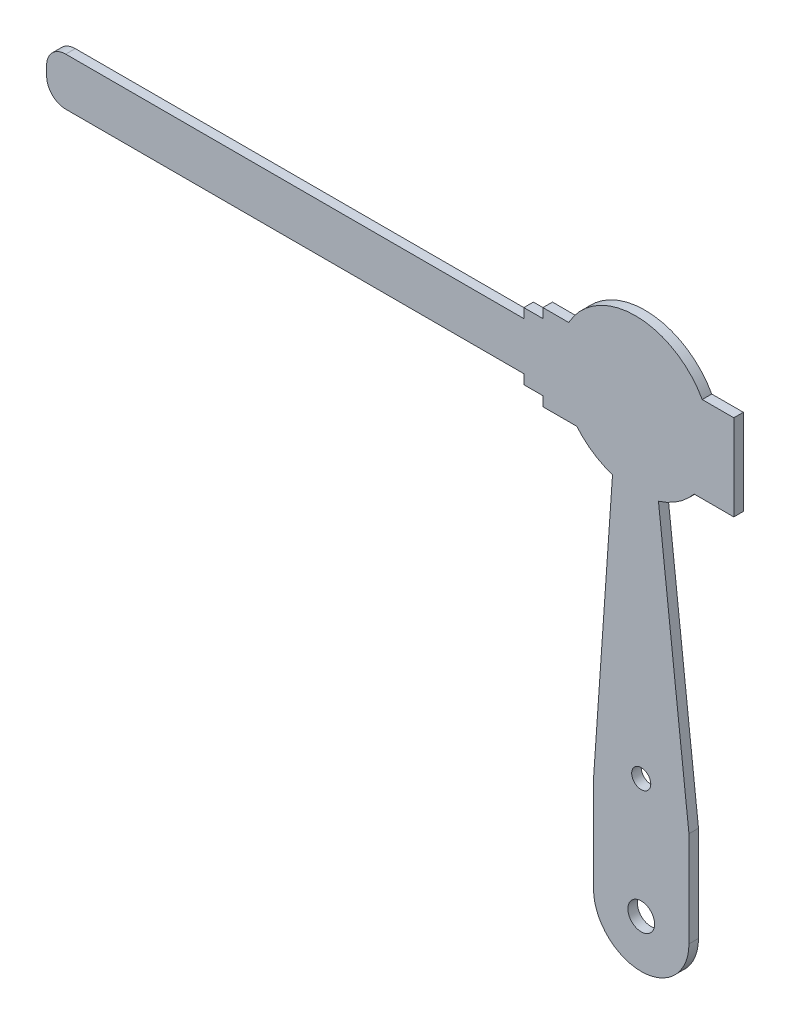
ISO-10303-21;
HEADER;
FILE_DESCRIPTION(('STEP AP214'),'2;1');
FILE_NAME('part.step','',(''),(''),'','','');
FILE_SCHEMA(('AUTOMOTIVE_DESIGN { 1 0 10303 214 1 1 1 1 }'));
ENDSEC;
DATA;
#1=APPLICATION_CONTEXT('core data for automotive mechanical design processes');
#2=APPLICATION_PROTOCOL_DEFINITION('international standard','automotive_design',2000,#1);
#3=PRODUCT_CONTEXT('',#1,'mechanical');
#4=PRODUCT('Part','Part','',(#3));
#5=PRODUCT_RELATED_PRODUCT_CATEGORY('part','',(#4));
#6=PRODUCT_DEFINITION_FORMATION('','',#4);
#7=PRODUCT_DEFINITION_CONTEXT('part definition',#1,'design');
#8=PRODUCT_DEFINITION('design','',#6,#7);
#9=PRODUCT_DEFINITION_SHAPE('','',#8);
#10=(LENGTH_UNIT() NAMED_UNIT(*) SI_UNIT(.MILLI.,.METRE.));
#11=(NAMED_UNIT(*) PLANE_ANGLE_UNIT() SI_UNIT($,.RADIAN.));
#12=(NAMED_UNIT(*) SI_UNIT($,.STERADIAN.) SOLID_ANGLE_UNIT());
#13=UNCERTAINTY_MEASURE_WITH_UNIT(LENGTH_MEASURE(1.E-05),#10,'distance_accuracy_value','');
#14=(GEOMETRIC_REPRESENTATION_CONTEXT(3) GLOBAL_UNCERTAINTY_ASSIGNED_CONTEXT((#13)) GLOBAL_UNIT_ASSIGNED_CONTEXT((#10,
#11,#12)) REPRESENTATION_CONTEXT('',''));
#15=CARTESIAN_POINT('',(0.,0.,0.));
#16=DIRECTION('',(0.,0.,1.));
#17=DIRECTION('',(1.,0.,0.));
#18=AXIS2_PLACEMENT_3D('',#15,#16,#17);
#19=CARTESIAN_POINT('',(-15.0936104431096,29.3338517533737,-1.));
#20=DIRECTION('',(0.,0.,1.));
#21=DIRECTION('',(1.,0.,0.));
#22=AXIS2_PLACEMENT_3D('',#19,#20,#21);
#23=CYLINDRICAL_SURFACE('',#22,2.00000000000009);
#24=CARTESIAN_POINT('',(-15.0936104431096,29.3338517533737,0.));
#25=DIRECTION('',(0.,0.,1.));
#26=DIRECTION('',(1.,0.,0.));
#27=AXIS2_PLACEMENT_3D('',#24,#25,#26);
#28=CIRCLE('',#27,2.00000000000009);
#29=CARTESIAN_POINT('',(-17.0936104431096,29.3338517533737,0.));
#30=VERTEX_POINT('',#29);
#31=CARTESIAN_POINT('',(-15.0936104431096,27.3338517533735,0.));
#32=VERTEX_POINT('',#31);
#33=EDGE_CURVE('E231',#30,#32,#28,.T.);
#34=ORIENTED_EDGE('',*,*,#33,.F.);
#35=DIRECTION('',(0.,0.,1.));
#36=VECTOR('',#35,1.);
#37=CARTESIAN_POINT('',(-17.0936104431096,29.3338517533737,-1.));
#38=LINE('',#37,#36);
#39=CARTESIAN_POINT('',(-17.0936104431096,29.3338517533737,-1.));
#40=VERTEX_POINT('',#39);
#41=EDGE_CURVE('E11',#40,#30,#38,.T.);
#42=ORIENTED_EDGE('',*,*,#41,.F.);
#43=CARTESIAN_POINT('',(-15.0936104431096,29.3338517533737,-1.));
#44=DIRECTION('',(0.,0.,1.));
#45=DIRECTION('',(1.,0.,0.));
#46=AXIS2_PLACEMENT_3D('',#43,#44,#45);
#47=CIRCLE('',#46,2.00000000000009);
#48=CARTESIAN_POINT('',(-15.0936104431096,27.3338517533735,-1.));
#49=VERTEX_POINT('',#48);
#50=EDGE_CURVE('E300',#40,#49,#47,.T.);
#51=ORIENTED_EDGE('',*,*,#50,.T.);
#52=DIRECTION('',(0.,0.,1.));
#53=VECTOR('',#52,1.);
#54=CARTESIAN_POINT('',(-15.0936104431096,27.3338517533735,-1.));
#55=LINE('',#54,#53);
#56=EDGE_CURVE('E41',#49,#32,#55,.T.);
#57=ORIENTED_EDGE('',*,*,#56,.T.);
#58=EDGE_LOOP('',(#34,#42,#51,#57));
#59=FACE_BOUND('',#58,.T.);
#60=ADVANCED_FACE('F38',(#59),#23,.T.);
#61=CARTESIAN_POINT('',(-17.0936104431096,29.3338517533737,-1.));
#62=DIRECTION('',(-1.,0.,0.));
#63=DIRECTION('',(0.,0.,1.));
#64=AXIS2_PLACEMENT_3D('',#61,#62,#63);
#65=PLANE('',#64);
#66=DIRECTION('',(0.,-1.,0.));
#67=VECTOR('',#66,1.);
#68=CARTESIAN_POINT('',(-17.0936104431096,29.3338517533737,0.));
#69=LINE('',#68,#67);
#70=CARTESIAN_POINT('',(-17.0936104431096,30.3338517533737,0.));
#71=VERTEX_POINT('',#70);
#72=EDGE_CURVE('E298',#71,#30,#69,.T.);
#73=ORIENTED_EDGE('',*,*,#72,.F.);
#74=DIRECTION('',(0.,0.,1.));
#75=VECTOR('',#74,1.);
#76=CARTESIAN_POINT('',(-17.0936104431096,30.3338517533737,-1.));
#77=LINE('',#76,#75);
#78=CARTESIAN_POINT('',(-17.0936104431096,30.3338517533737,-1.));
#79=VERTEX_POINT('',#78);
#80=EDGE_CURVE('E47',#79,#71,#77,.T.);
#81=ORIENTED_EDGE('',*,*,#80,.F.);
#82=DIRECTION('',(0.,-1.,0.));
#83=VECTOR('',#82,1.);
#84=CARTESIAN_POINT('',(-17.0936104431096,29.3338517533737,-1.));
#85=LINE('',#84,#83);
#86=EDGE_CURVE('E221',#79,#40,#85,.T.);
#87=ORIENTED_EDGE('',*,*,#86,.T.);
#88=ORIENTED_EDGE('',*,*,#41,.T.);
#89=EDGE_LOOP('',(#73,#81,#87,#88));
#90=FACE_BOUND('',#89,.T.);
#91=ADVANCED_FACE('F344',(#90),#65,.T.);
#92=CARTESIAN_POINT('',(-15.0936104431096,30.3338517533737,-1.));
#93=DIRECTION('',(0.,0.,1.));
#94=DIRECTION('',(1.,0.,0.));
#95=AXIS2_PLACEMENT_3D('',#92,#93,#94);
#96=CYLINDRICAL_SURFACE('',#95,2.00000000000001);
#97=CARTESIAN_POINT('',(-15.0936104431096,30.3338517533737,0.));
#98=DIRECTION('',(0.,0.,1.));
#99=DIRECTION('',(1.,0.,0.));
#100=AXIS2_PLACEMENT_3D('',#97,#98,#99);
#101=CIRCLE('',#100,2.00000000000001);
#102=CARTESIAN_POINT('',(-15.0936104431095,32.3338517533737,0.));
#103=VERTEX_POINT('',#102);
#104=EDGE_CURVE('E208',#103,#71,#101,.T.);
#105=ORIENTED_EDGE('',*,*,#104,.F.);
#106=DIRECTION('',(0.,0.,1.));
#107=VECTOR('',#106,1.);
#108=CARTESIAN_POINT('',(-15.0936104431095,32.3338517533737,-1.));
#109=LINE('',#108,#107);
#110=CARTESIAN_POINT('',(-15.0936104431095,32.3338517533737,-1.));
#111=VERTEX_POINT('',#110);
#112=EDGE_CURVE('E203',#111,#103,#109,.T.);
#113=ORIENTED_EDGE('',*,*,#112,.F.);
#114=CARTESIAN_POINT('',(-15.0936104431096,30.3338517533737,-1.));
#115=DIRECTION('',(0.,0.,1.));
#116=DIRECTION('',(1.,0.,0.));
#117=AXIS2_PLACEMENT_3D('',#114,#115,#116);
#118=CIRCLE('',#117,2.00000000000001);
#119=EDGE_CURVE('E206',#111,#79,#118,.T.);
#120=ORIENTED_EDGE('',*,*,#119,.T.);
#121=ORIENTED_EDGE('',*,*,#80,.T.);
#122=EDGE_LOOP('',(#105,#113,#120,#121));
#123=FACE_BOUND('',#122,.T.);
#124=ADVANCED_FACE('F205',(#123),#96,.T.);
#125=CARTESIAN_POINT('',(-15.0936104431095,32.3338517533737,-1.));
#126=DIRECTION('',(0.,1.,0.));
#127=DIRECTION('',(0.,0.,1.));
#128=AXIS2_PLACEMENT_3D('',#125,#126,#127);
#129=PLANE('',#128);
#130=DIRECTION('',(-1.,0.,0.));
#131=VECTOR('',#130,1.);
#132=CARTESIAN_POINT('',(-15.0936104431095,32.3338517533737,0.));
#133=LINE('',#132,#131);
#134=CARTESIAN_POINT('',(32.9063895568905,32.3338517533737,0.));
#135=VERTEX_POINT('',#134);
#136=EDGE_CURVE('E295',#135,#103,#133,.T.);
#137=ORIENTED_EDGE('',*,*,#136,.F.);
#138=DIRECTION('',(0.,0.,1.));
#139=VECTOR('',#138,1.);
#140=CARTESIAN_POINT('',(32.9063895568905,32.3338517533737,-1.));
#141=LINE('',#140,#139);
#142=CARTESIAN_POINT('',(32.9063895568905,32.3338517533737,-1.));
#143=VERTEX_POINT('',#142);
#144=EDGE_CURVE('E213',#143,#135,#141,.T.);
#145=ORIENTED_EDGE('',*,*,#144,.F.);
#146=DIRECTION('',(-1.,0.,0.));
#147=VECTOR('',#146,1.);
#148=CARTESIAN_POINT('',(-15.0936104431095,32.3338517533737,-1.));
#149=LINE('',#148,#147);
#150=EDGE_CURVE('E219',#143,#111,#149,.T.);
#151=ORIENTED_EDGE('',*,*,#150,.T.);
#152=ORIENTED_EDGE('',*,*,#112,.T.);
#153=EDGE_LOOP('',(#137,#145,#151,#152));
#154=FACE_BOUND('',#153,.T.);
#155=ADVANCED_FACE('F223',(#154),#129,.T.);
#156=CARTESIAN_POINT('',(32.9063895568905,32.3338517533737,-1.));
#157=DIRECTION('',(-1.,0.,0.));
#158=DIRECTION('',(0.,0.,1.));
#159=AXIS2_PLACEMENT_3D('',#156,#157,#158);
#160=PLANE('',#159);
#161=DIRECTION('',(0.,-1.,0.));
#162=VECTOR('',#161,1.);
#163=CARTESIAN_POINT('',(32.9063895568905,32.3338517533737,0.));
#164=LINE('',#163,#162);
#165=CARTESIAN_POINT('',(32.9063895568905,33.3338517533735,0.));
#166=VERTEX_POINT('',#165);
#167=EDGE_CURVE('E292',#166,#135,#164,.T.);
#168=ORIENTED_EDGE('',*,*,#167,.F.);
#169=DIRECTION('',(0.,0.,1.));
#170=VECTOR('',#169,1.);
#171=CARTESIAN_POINT('',(32.9063895568905,33.3338517533735,-1.));
#172=LINE('',#171,#170);
#173=CARTESIAN_POINT('',(32.9063895568905,33.3338517533735,-1.));
#174=VERTEX_POINT('',#173);
#175=EDGE_CURVE('E304',#174,#166,#172,.T.);
#176=ORIENTED_EDGE('',*,*,#175,.F.);
#177=DIRECTION('',(0.,-1.,0.));
#178=VECTOR('',#177,1.);
#179=CARTESIAN_POINT('',(32.9063895568905,32.3338517533737,-1.));
#180=LINE('',#179,#178);
#181=EDGE_CURVE('E224',#174,#143,#180,.T.);
#182=ORIENTED_EDGE('',*,*,#181,.T.);
#183=ORIENTED_EDGE('',*,*,#144,.T.);
#184=EDGE_LOOP('',(#168,#176,#182,#183));
#185=FACE_BOUND('',#184,.T.);
#186=ADVANCED_FACE('F357',(#185),#160,.T.);
#187=CARTESIAN_POINT('',(32.9063895568905,33.3338517533735,-1.));
#188=DIRECTION('',(0.,1.,0.));
#189=DIRECTION('',(0.,0.,1.));
#190=AXIS2_PLACEMENT_3D('',#187,#188,#189);
#191=PLANE('',#190);
#192=DIRECTION('',(-1.,0.,0.));
#193=VECTOR('',#192,1.);
#194=CARTESIAN_POINT('',(32.9063895568905,33.3338517533735,0.));
#195=LINE('',#194,#193);
#196=CARTESIAN_POINT('',(34.9063895568905,33.3338517533735,0.));
#197=VERTEX_POINT('',#196);
#198=EDGE_CURVE('E289',#197,#166,#195,.T.);
#199=ORIENTED_EDGE('',*,*,#198,.F.);
#200=DIRECTION('',(0.,0.,1.));
#201=VECTOR('',#200,1.);
#202=CARTESIAN_POINT('',(34.9063895568905,33.3338517533735,-1.));
#203=LINE('',#202,#201);
#204=CARTESIAN_POINT('',(34.9063895568905,33.3338517533735,-1.));
#205=VERTEX_POINT('',#204);
#206=EDGE_CURVE('E306',#205,#197,#203,.T.);
#207=ORIENTED_EDGE('',*,*,#206,.F.);
#208=DIRECTION('',(-1.,0.,0.));
#209=VECTOR('',#208,1.);
#210=CARTESIAN_POINT('',(32.9063895568905,33.3338517533735,-1.));
#211=LINE('',#210,#209);
#212=EDGE_CURVE('E226',#205,#174,#211,.T.);
#213=ORIENTED_EDGE('',*,*,#212,.T.);
#214=ORIENTED_EDGE('',*,*,#175,.T.);
#215=EDGE_LOOP('',(#199,#207,#213,#214));
#216=FACE_BOUND('',#215,.T.);
#217=ADVANCED_FACE('F360',(#216),#191,.T.);
#218=CARTESIAN_POINT('',(34.9063895568905,33.3338517533735,-1.));
#219=DIRECTION('',(-1.,0.,0.));
#220=DIRECTION('',(0.,0.,1.));
#221=AXIS2_PLACEMENT_3D('',#218,#219,#220);
#222=PLANE('',#221);
#223=DIRECTION('',(0.,-1.,0.));
#224=VECTOR('',#223,1.);
#225=CARTESIAN_POINT('',(34.9063895568905,33.3338517533735,0.));
#226=LINE('',#225,#224);
#227=CARTESIAN_POINT('',(34.9063895568905,34.3338517533735,0.));
#228=VERTEX_POINT('',#227);
#229=EDGE_CURVE('E286',#228,#197,#226,.T.);
#230=ORIENTED_EDGE('',*,*,#229,.F.);
#231=DIRECTION('',(0.,0.,1.));
#232=VECTOR('',#231,1.);
#233=CARTESIAN_POINT('',(34.9063895568905,34.3338517533735,-1.));
#234=LINE('',#233,#232);
#235=CARTESIAN_POINT('',(34.9063895568905,34.3338517533735,-1.));
#236=VERTEX_POINT('',#235);
#237=EDGE_CURVE('E308',#236,#228,#234,.T.);
#238=ORIENTED_EDGE('',*,*,#237,.F.);
#239=DIRECTION('',(0.,-1.,0.));
#240=VECTOR('',#239,1.);
#241=CARTESIAN_POINT('',(34.9063895568905,33.3338517533735,-1.));
#242=LINE('',#241,#240);
#243=EDGE_CURVE('E518',#236,#205,#242,.T.);
#244=ORIENTED_EDGE('',*,*,#243,.T.);
#245=ORIENTED_EDGE('',*,*,#206,.T.);
#246=EDGE_LOOP('',(#230,#238,#244,#245));
#247=FACE_BOUND('',#246,.T.);
#248=ADVANCED_FACE('F364',(#247),#222,.T.);
#249=CARTESIAN_POINT('',(34.9063895568905,34.3338517533735,-1.));
#250=DIRECTION('',(0.,1.,0.));
#251=DIRECTION('',(0.,0.,1.));
#252=AXIS2_PLACEMENT_3D('',#249,#250,#251);
#253=PLANE('',#252);
#254=DIRECTION('',(-1.,0.,0.));
#255=VECTOR('',#254,1.);
#256=CARTESIAN_POINT('',(34.9063895568905,34.3338517533735,0.));
#257=LINE('',#256,#255);
#258=CARTESIAN_POINT('',(37.6108311146424,34.3338517533735,0.));
#259=VERTEX_POINT('',#258);
#260=EDGE_CURVE('E283',#259,#228,#257,.T.);
#261=ORIENTED_EDGE('',*,*,#260,.F.);
#262=DIRECTION('',(0.,0.,1.));
#263=VECTOR('',#262,1.);
#264=CARTESIAN_POINT('',(37.6108311146424,34.3338517533735,-1.));
#265=LINE('',#264,#263);
#266=CARTESIAN_POINT('',(37.6108311146424,34.3338517533735,-1.));
#267=VERTEX_POINT('',#266);
#268=EDGE_CURVE('E310',#267,#259,#265,.T.);
#269=ORIENTED_EDGE('',*,*,#268,.F.);
#270=DIRECTION('',(-1.,0.,0.));
#271=VECTOR('',#270,1.);
#272=CARTESIAN_POINT('',(34.9063895568905,34.3338517533735,-1.));
#273=LINE('',#272,#271);
#274=EDGE_CURVE('E515',#267,#236,#273,.T.);
#275=ORIENTED_EDGE('',*,*,#274,.T.);
#276=ORIENTED_EDGE('',*,*,#237,.T.);
#277=EDGE_LOOP('',(#261,#269,#275,#276));
#278=FACE_BOUND('',#277,.T.);
#279=ADVANCED_FACE('F368',(#278),#253,.T.);
#280=CARTESIAN_POINT('',(44.6043633476465,30.4492015881806,-1.));
#281=DIRECTION('',(0.,0.,1.));
#282=DIRECTION('',(1.,0.,0.));
#283=AXIS2_PLACEMENT_3D('',#280,#281,#282);
#284=CYLINDRICAL_SURFACE('',#283,8.);
#285=CARTESIAN_POINT('',(44.6043633476465,30.4492015881806,0.));
#286=DIRECTION('',(0.,0.,1.));
#287=DIRECTION('',(-1.,0.,0.));
#288=AXIS2_PLACEMENT_3D('',#285,#286,#287);
#289=CIRCLE('',#288,8.);
#290=CARTESIAN_POINT('',(51.5978955806505,34.3338517533735,0.));
#291=VERTEX_POINT('',#290);
#292=EDGE_CURVE('E280',#291,#259,#289,.T.);
#293=ORIENTED_EDGE('',*,*,#292,.F.);
#294=DIRECTION('',(0.,0.,1.));
#295=VECTOR('',#294,1.);
#296=CARTESIAN_POINT('',(51.5978955806505,34.3338517533735,-1.));
#297=LINE('',#296,#295);
#298=CARTESIAN_POINT('',(51.5978955806505,34.3338517533735,-1.));
#299=VERTEX_POINT('',#298);
#300=EDGE_CURVE('E312',#299,#291,#297,.T.);
#301=ORIENTED_EDGE('',*,*,#300,.F.);
#302=CARTESIAN_POINT('',(44.6043633476465,30.4492015881806,-1.));
#303=DIRECTION('',(0.,0.,1.));
#304=DIRECTION('',(-1.,0.,0.));
#305=AXIS2_PLACEMENT_3D('',#302,#303,#304);
#306=CIRCLE('',#305,8.);
#307=EDGE_CURVE('E512',#299,#267,#306,.T.);
#308=ORIENTED_EDGE('',*,*,#307,.T.);
#309=ORIENTED_EDGE('',*,*,#268,.T.);
#310=EDGE_LOOP('',(#293,#301,#308,#309));
#311=FACE_BOUND('',#310,.T.);
#312=ADVANCED_FACE('F372',(#311),#284,.T.);
#313=CARTESIAN_POINT('',(51.5978955806505,34.3338517533735,-1.));
#314=DIRECTION('',(0.,1.,0.));
#315=DIRECTION('',(0.,0.,1.));
#316=AXIS2_PLACEMENT_3D('',#313,#314,#315);
#317=PLANE('',#316);
#318=DIRECTION('',(-1.,0.,0.));
#319=VECTOR('',#318,1.);
#320=CARTESIAN_POINT('',(51.5978955806505,34.3338517533735,0.));
#321=LINE('',#320,#319);
#322=CARTESIAN_POINT('',(54.9063895568905,34.3338517533735,0.));
#323=VERTEX_POINT('',#322);
#324=EDGE_CURVE('E277',#323,#291,#321,.T.);
#325=ORIENTED_EDGE('',*,*,#324,.F.);
#326=DIRECTION('',(0.,0.,1.));
#327=VECTOR('',#326,1.);
#328=CARTESIAN_POINT('',(54.9063895568905,34.3338517533735,-1.));
#329=LINE('',#328,#327);
#330=CARTESIAN_POINT('',(54.9063895568905,34.3338517533735,-1.));
#331=VERTEX_POINT('',#330);
#332=EDGE_CURVE('E314',#331,#323,#329,.T.);
#333=ORIENTED_EDGE('',*,*,#332,.F.);
#334=DIRECTION('',(-1.,0.,0.));
#335=VECTOR('',#334,1.);
#336=CARTESIAN_POINT('',(51.5978955806505,34.3338517533735,-1.));
#337=LINE('',#336,#335);
#338=EDGE_CURVE('E509',#331,#299,#337,.T.);
#339=ORIENTED_EDGE('',*,*,#338,.T.);
#340=ORIENTED_EDGE('',*,*,#300,.T.);
#341=EDGE_LOOP('',(#325,#333,#339,#340));
#342=FACE_BOUND('',#341,.T.);
#343=ADVANCED_FACE('F376',(#342),#317,.T.);
#344=CARTESIAN_POINT('',(54.9063895568905,34.3338517533735,-1.));
#345=DIRECTION('',(1.,0.,0.));
#346=DIRECTION('',(0.,1.,0.));
#347=AXIS2_PLACEMENT_3D('',#344,#345,#346);
#348=PLANE('',#347);
#349=DIRECTION('',(0.,1.,0.));
#350=VECTOR('',#349,1.);
#351=CARTESIAN_POINT('',(54.9063895568905,34.3338517533735,0.));
#352=LINE('',#351,#350);
#353=CARTESIAN_POINT('',(54.9063895568905,25.3338517533734,0.));
#354=VERTEX_POINT('',#353);
#355=EDGE_CURVE('E274',#354,#323,#352,.T.);
#356=ORIENTED_EDGE('',*,*,#355,.F.);
#357=DIRECTION('',(0.,0.,1.));
#358=VECTOR('',#357,1.);
#359=CARTESIAN_POINT('',(54.9063895568905,25.3338517533734,-1.));
#360=LINE('',#359,#358);
#361=CARTESIAN_POINT('',(54.9063895568905,25.3338517533734,-1.));
#362=VERTEX_POINT('',#361);
#363=EDGE_CURVE('E316',#362,#354,#360,.T.);
#364=ORIENTED_EDGE('',*,*,#363,.F.);
#365=DIRECTION('',(0.,1.,0.));
#366=VECTOR('',#365,1.);
#367=CARTESIAN_POINT('',(54.9063895568905,34.3338517533735,-1.));
#368=LINE('',#367,#366);
#369=EDGE_CURVE('E506',#362,#331,#368,.T.);
#370=ORIENTED_EDGE('',*,*,#369,.T.);
#371=ORIENTED_EDGE('',*,*,#332,.T.);
#372=EDGE_LOOP('',(#356,#364,#370,#371));
#373=FACE_BOUND('',#372,.T.);
#374=ADVANCED_FACE('F380',(#373),#348,.T.);
#375=CARTESIAN_POINT('',(54.9063895568905,25.3338517533734,-1.));
#376=DIRECTION('',(0.,-1.,0.));
#377=DIRECTION('',(1.,0.,0.));
#378=AXIS2_PLACEMENT_3D('',#375,#376,#377);
#379=PLANE('',#378);
#380=DIRECTION('',(1.,0.,0.));
#381=VECTOR('',#380,1.);
#382=CARTESIAN_POINT('',(54.9063895568905,25.3338517533734,0.));
#383=LINE('',#382,#381);
#384=CARTESIAN_POINT('',(50.7552328851621,25.3338517533734,0.));
#385=VERTEX_POINT('',#384);
#386=EDGE_CURVE('E271',#385,#354,#383,.T.);
#387=ORIENTED_EDGE('',*,*,#386,.F.);
#388=DIRECTION('',(0.,0.,1.));
#389=VECTOR('',#388,1.);
#390=CARTESIAN_POINT('',(50.7552328851621,25.3338517533734,-1.));
#391=LINE('',#390,#389);
#392=CARTESIAN_POINT('',(50.7552328851621,25.3338517533734,-1.));
#393=VERTEX_POINT('',#392);
#394=EDGE_CURVE('E318',#393,#385,#391,.T.);
#395=ORIENTED_EDGE('',*,*,#394,.F.);
#396=DIRECTION('',(1.,0.,0.));
#397=VECTOR('',#396,1.);
#398=CARTESIAN_POINT('',(54.9063895568905,25.3338517533734,-1.));
#399=LINE('',#398,#397);
#400=EDGE_CURVE('E503',#393,#362,#399,.T.);
#401=ORIENTED_EDGE('',*,*,#400,.T.);
#402=ORIENTED_EDGE('',*,*,#363,.T.);
#403=EDGE_LOOP('',(#387,#395,#401,#402));
#404=FACE_BOUND('',#403,.T.);
#405=ADVANCED_FACE('F384',(#404),#379,.T.);
#406=CARTESIAN_POINT('',(44.6043633476463,30.4492015881808,-1.));
#407=DIRECTION('',(0.,0.,1.));
#408=DIRECTION('',(1.,0.,0.));
#409=AXIS2_PLACEMENT_3D('',#406,#407,#408);
#410=CYLINDRICAL_SURFACE('',#409,8.0000000000002);
#411=CARTESIAN_POINT('',(44.6043633476463,30.4492015881808,0.));
#412=DIRECTION('',(0.,0.,1.));
#413=DIRECTION('',(1.,0.,0.));
#414=AXIS2_PLACEMENT_3D('',#411,#412,#413);
#415=CIRCLE('',#414,8.0000000000002);
#416=CARTESIAN_POINT('',(47.0108715570586,22.8197377644226,0.));
#417=VERTEX_POINT('',#416);
#418=EDGE_CURVE('E268',#417,#385,#415,.T.);
#419=ORIENTED_EDGE('',*,*,#418,.F.);
#420=DIRECTION('',(0.,0.,1.));
#421=VECTOR('',#420,1.);
#422=CARTESIAN_POINT('',(47.0108715570586,22.8197377644226,-1.));
#423=LINE('',#422,#421);
#424=CARTESIAN_POINT('',(47.0108715570586,22.8197377644226,-1.));
#425=VERTEX_POINT('',#424);
#426=EDGE_CURVE('E320',#425,#417,#423,.T.);
#427=ORIENTED_EDGE('',*,*,#426,.F.);
#428=CARTESIAN_POINT('',(44.6043633476463,30.4492015881808,-1.));
#429=DIRECTION('',(0.,0.,1.));
#430=DIRECTION('',(1.,0.,0.));
#431=AXIS2_PLACEMENT_3D('',#428,#429,#430);
#432=CIRCLE('',#431,8.0000000000002);
#433=EDGE_CURVE('E500',#425,#393,#432,.T.);
#434=ORIENTED_EDGE('',*,*,#433,.T.);
#435=ORIENTED_EDGE('',*,*,#394,.T.);
#436=EDGE_LOOP('',(#419,#427,#434,#435));
#437=FACE_BOUND('',#436,.T.);
#438=ADVANCED_FACE('F388',(#437),#410,.T.);
#439=CARTESIAN_POINT('',(50.2059903999995,-5.76156160002383,-1.));
#440=DIRECTION('',(0.993809401226692,0.111098487989008,0.));
#441=DIRECTION('',(-0.111098487989008,0.993809401226692,0.));
#442=AXIS2_PLACEMENT_3D('',#439,#440,#441);
#443=PLANE('',#442);
#444=DIRECTION('',(-0.111098487989008,0.993809401226692,0.));
#445=VECTOR('',#444,1.);
#446=CARTESIAN_POINT('',(50.2059903999995,-5.76156160002383,0.));
#447=LINE('',#446,#445);
#448=CARTESIAN_POINT('',(50.2059903999995,-5.76156160002383,0.));
#449=VERTEX_POINT('',#448);
#450=EDGE_CURVE('E265',#449,#417,#447,.T.);
#451=ORIENTED_EDGE('',*,*,#450,.F.);
#452=DIRECTION('',(0.,0.,1.));
#453=VECTOR('',#452,1.);
#454=CARTESIAN_POINT('',(50.2059903999995,-5.76156160002383,-1.));
#455=LINE('',#454,#453);
#456=CARTESIAN_POINT('',(50.2059903999995,-5.76156160002383,-1.));
#457=VERTEX_POINT('',#456);
#458=EDGE_CURVE('E322',#457,#449,#455,.T.);
#459=ORIENTED_EDGE('',*,*,#458,.F.);
#460=DIRECTION('',(-0.111098487989008,0.993809401226692,0.));
#461=VECTOR('',#460,1.);
#462=CARTESIAN_POINT('',(50.2059903999995,-5.76156160002383,-1.));
#463=LINE('',#462,#461);
#464=EDGE_CURVE('E497',#457,#425,#463,.T.);
#465=ORIENTED_EDGE('',*,*,#464,.T.);
#466=ORIENTED_EDGE('',*,*,#426,.T.);
#467=EDGE_LOOP('',(#451,#459,#465,#466));
#468=FACE_BOUND('',#467,.T.);
#469=ADVANCED_FACE('F392',(#468),#443,.T.);
#470=CARTESIAN_POINT('',(50.2059903999995,-5.76156160002383,-1.));
#471=DIRECTION('',(1.,0.,0.));
#472=DIRECTION('',(0.,1.,0.));
#473=AXIS2_PLACEMENT_3D('',#470,#471,#472);
#474=PLANE('',#473);
#475=DIRECTION('',(0.,1.,0.));
#476=VECTOR('',#475,1.);
#477=CARTESIAN_POINT('',(50.2059903999995,-5.76156160002383,0.));
#478=LINE('',#477,#476);
#479=CARTESIAN_POINT('',(50.2059903999995,-15.7615616000238,0.));
#480=VERTEX_POINT('',#479);
#481=EDGE_CURVE('E262',#480,#449,#478,.T.);
#482=ORIENTED_EDGE('',*,*,#481,.F.);
#483=DIRECTION('',(0.,0.,1.));
#484=VECTOR('',#483,1.);
#485=CARTESIAN_POINT('',(50.2059903999995,-15.7615616000238,-1.));
#486=LINE('',#485,#484);
#487=CARTESIAN_POINT('',(50.2059903999995,-15.7615616000238,-1.));
#488=VERTEX_POINT('',#487);
#489=EDGE_CURVE('E324',#488,#480,#486,.T.);
#490=ORIENTED_EDGE('',*,*,#489,.F.);
#491=DIRECTION('',(0.,1.,0.));
#492=VECTOR('',#491,1.);
#493=CARTESIAN_POINT('',(50.2059903999995,-5.76156160002383,-1.));
#494=LINE('',#493,#492);
#495=EDGE_CURVE('E494',#488,#457,#494,.T.);
#496=ORIENTED_EDGE('',*,*,#495,.T.);
#497=ORIENTED_EDGE('',*,*,#458,.T.);
#498=EDGE_LOOP('',(#482,#490,#496,#497));
#499=FACE_BOUND('',#498,.T.);
#500=ADVANCED_FACE('F396',(#499),#474,.T.);
#501=CARTESIAN_POINT('',(45.2059903999995,-15.7615616000238,-1.));
#502=DIRECTION('',(0.,0.,1.));
#503=DIRECTION('',(1.,0.,0.));
#504=AXIS2_PLACEMENT_3D('',#501,#502,#503);
#505=CYLINDRICAL_SURFACE('',#504,5.);
#506=CARTESIAN_POINT('',(45.2059903999995,-15.7615616000238,0.));
#507=DIRECTION('',(0.,0.,1.));
#508=DIRECTION('',(1.,0.,0.));
#509=AXIS2_PLACEMENT_3D('',#506,#507,#508);
#510=CIRCLE('',#509,5.);
#511=CARTESIAN_POINT('',(40.2059903999995,-15.7615616000238,0.));
#512=VERTEX_POINT('',#511);
#513=EDGE_CURVE('E259',#512,#480,#510,.T.);
#514=ORIENTED_EDGE('',*,*,#513,.F.);
#515=DIRECTION('',(0.,0.,1.));
#516=VECTOR('',#515,1.);
#517=CARTESIAN_POINT('',(40.2059903999995,-15.7615616000238,-1.));
#518=LINE('',#517,#516);
#519=CARTESIAN_POINT('',(40.2059903999995,-15.7615616000238,-1.));
#520=VERTEX_POINT('',#519);
#521=EDGE_CURVE('E326',#520,#512,#518,.T.);
#522=ORIENTED_EDGE('',*,*,#521,.F.);
#523=CARTESIAN_POINT('',(45.2059903999995,-15.7615616000238,-1.));
#524=DIRECTION('',(0.,0.,1.));
#525=DIRECTION('',(1.,0.,0.));
#526=AXIS2_PLACEMENT_3D('',#523,#524,#525);
#527=CIRCLE('',#526,5.);
#528=EDGE_CURVE('E491',#520,#488,#527,.T.);
#529=ORIENTED_EDGE('',*,*,#528,.T.);
#530=ORIENTED_EDGE('',*,*,#489,.T.);
#531=EDGE_LOOP('',(#514,#522,#529,#530));
#532=FACE_BOUND('',#531,.T.);
#533=ADVANCED_FACE('F400',(#532),#505,.T.);
#534=CARTESIAN_POINT('',(40.2059903999995,-5.76156160002383,-1.));
#535=DIRECTION('',(-1.,0.,0.));
#536=DIRECTION('',(0.,-1.,0.));
#537=AXIS2_PLACEMENT_3D('',#534,#535,#536);
#538=PLANE('',#537);
#539=DIRECTION('',(0.,-1.,0.));
#540=VECTOR('',#539,1.);
#541=CARTESIAN_POINT('',(40.2059903999995,-5.76156160002383,0.));
#542=LINE('',#541,#540);
#543=CARTESIAN_POINT('',(40.2059903999995,-5.76156160002383,0.));
#544=VERTEX_POINT('',#543);
#545=EDGE_CURVE('E256',#544,#512,#542,.T.);
#546=ORIENTED_EDGE('',*,*,#545,.F.);
#547=DIRECTION('',(0.,0.,1.));
#548=VECTOR('',#547,1.);
#549=CARTESIAN_POINT('',(40.2059903999995,-5.76156160002383,-1.));
#550=LINE('',#549,#548);
#551=CARTESIAN_POINT('',(40.2059903999995,-5.76156160002383,-1.));
#552=VERTEX_POINT('',#551);
#553=EDGE_CURVE('E328',#552,#544,#550,.T.);
#554=ORIENTED_EDGE('',*,*,#553,.F.);
#555=DIRECTION('',(0.,-1.,0.));
#556=VECTOR('',#555,1.);
#557=CARTESIAN_POINT('',(40.2059903999995,-5.76156160002383,-1.));
#558=LINE('',#557,#556);
#559=EDGE_CURVE('E488',#552,#520,#558,.T.);
#560=ORIENTED_EDGE('',*,*,#559,.T.);
#561=ORIENTED_EDGE('',*,*,#521,.T.);
#562=EDGE_LOOP('',(#546,#554,#560,#561));
#563=FACE_BOUND('',#562,.T.);
#564=ADVANCED_FACE('F404',(#563),#538,.T.);
#565=CARTESIAN_POINT('',(40.2059903999995,-5.76156160002383,-1.));
#566=DIRECTION('',(-0.997580379345878,0.069522562842112,0.));
#567=DIRECTION('',(-0.069522562842112,-0.997580379345878,0.));
#568=AXIS2_PLACEMENT_3D('',#565,#566,#567);
#569=PLANE('',#568);
#570=DIRECTION('',(-0.069522562842112,-0.997580379345877,0.));
#571=VECTOR('',#570,1.);
#572=CARTESIAN_POINT('',(40.2059903999995,-5.76156160002383,0.));
#573=LINE('',#572,#571);
#574=CARTESIAN_POINT('',(42.1978551382343,22.8197377644226,0.));
#575=VERTEX_POINT('',#574);
#576=EDGE_CURVE('E253',#575,#544,#573,.T.);
#577=ORIENTED_EDGE('',*,*,#576,.F.);
#578=DIRECTION('',(0.,0.,1.));
#579=VECTOR('',#578,1.);
#580=CARTESIAN_POINT('',(42.1978551382343,22.8197377644226,-1.));
#581=LINE('',#580,#579);
#582=CARTESIAN_POINT('',(42.1978551382343,22.8197377644226,-1.));
#583=VERTEX_POINT('',#582);
#584=EDGE_CURVE('E330',#583,#575,#581,.T.);
#585=ORIENTED_EDGE('',*,*,#584,.F.);
#586=DIRECTION('',(-0.069522562842112,-0.997580379345877,0.));
#587=VECTOR('',#586,1.);
#588=CARTESIAN_POINT('',(40.2059903999995,-5.76156160002383,-1.));
#589=LINE('',#588,#587);
#590=EDGE_CURVE('E485',#583,#552,#589,.T.);
#591=ORIENTED_EDGE('',*,*,#590,.T.);
#592=ORIENTED_EDGE('',*,*,#553,.T.);
#593=EDGE_LOOP('',(#577,#585,#591,#592));
#594=FACE_BOUND('',#593,.T.);
#595=ADVANCED_FACE('F408',(#594),#569,.T.);
#596=CARTESIAN_POINT('',(44.6043633476466,30.4492015881809,-1.));
#597=DIRECTION('',(0.,0.,1.));
#598=DIRECTION('',(1.,0.,0.));
#599=AXIS2_PLACEMENT_3D('',#596,#597,#598);
#600=CYLINDRICAL_SURFACE('',#599,8.00000000000028);
#601=CARTESIAN_POINT('',(44.6043633476466,30.4492015881809,0.));
#602=DIRECTION('',(0.,0.,1.));
#603=DIRECTION('',(-1.,0.,0.));
#604=AXIS2_PLACEMENT_3D('',#601,#602,#603);
#605=CIRCLE('',#604,8.00000000000028);
#606=CARTESIAN_POINT('',(38.4534938101308,25.3338517533734,0.));
#607=VERTEX_POINT('',#606);
#608=EDGE_CURVE('E250',#607,#575,#605,.T.);
#609=ORIENTED_EDGE('',*,*,#608,.F.);
#610=DIRECTION('',(0.,0.,1.));
#611=VECTOR('',#610,1.);
#612=CARTESIAN_POINT('',(38.4534938101308,25.3338517533734,-1.));
#613=LINE('',#612,#611);
#614=CARTESIAN_POINT('',(38.4534938101308,25.3338517533734,-1.));
#615=VERTEX_POINT('',#614);
#616=EDGE_CURVE('E332',#615,#607,#613,.T.);
#617=ORIENTED_EDGE('',*,*,#616,.F.);
#618=CARTESIAN_POINT('',(44.6043633476466,30.4492015881809,-1.));
#619=DIRECTION('',(0.,0.,1.));
#620=DIRECTION('',(-1.,0.,0.));
#621=AXIS2_PLACEMENT_3D('',#618,#619,#620);
#622=CIRCLE('',#621,8.00000000000028);
#623=EDGE_CURVE('E482',#615,#583,#622,.T.);
#624=ORIENTED_EDGE('',*,*,#623,.T.);
#625=ORIENTED_EDGE('',*,*,#584,.T.);
#626=EDGE_LOOP('',(#609,#617,#624,#625));
#627=FACE_BOUND('',#626,.T.);
#628=ADVANCED_FACE('F412',(#627),#600,.T.);
#629=CARTESIAN_POINT('',(34.9063895568904,25.3338517533734,-1.));
#630=DIRECTION('',(0.,-1.,0.));
#631=DIRECTION('',(0.,0.,-1.));
#632=AXIS2_PLACEMENT_3D('',#629,#630,#631);
#633=PLANE('',#632);
#634=DIRECTION('',(1.,0.,0.));
#635=VECTOR('',#634,1.);
#636=CARTESIAN_POINT('',(34.9063895568904,25.3338517533734,0.));
#637=LINE('',#636,#635);
#638=CARTESIAN_POINT('',(34.9063895568904,25.3338517533734,0.));
#639=VERTEX_POINT('',#638);
#640=EDGE_CURVE('E247',#639,#607,#637,.T.);
#641=ORIENTED_EDGE('',*,*,#640,.F.);
#642=DIRECTION('',(0.,0.,1.));
#643=VECTOR('',#642,1.);
#644=CARTESIAN_POINT('',(34.9063895568904,25.3338517533734,-1.));
#645=LINE('',#644,#643);
#646=CARTESIAN_POINT('',(34.9063895568904,25.3338517533734,-1.));
#647=VERTEX_POINT('',#646);
#648=EDGE_CURVE('E334',#647,#639,#645,.T.);
#649=ORIENTED_EDGE('',*,*,#648,.F.);
#650=DIRECTION('',(1.,0.,0.));
#651=VECTOR('',#650,1.);
#652=CARTESIAN_POINT('',(34.9063895568904,25.3338517533734,-1.));
#653=LINE('',#652,#651);
#654=EDGE_CURVE('E479',#647,#615,#653,.T.);
#655=ORIENTED_EDGE('',*,*,#654,.T.);
#656=ORIENTED_EDGE('',*,*,#616,.T.);
#657=EDGE_LOOP('',(#641,#649,#655,#656));
#658=FACE_BOUND('',#657,.T.);
#659=ADVANCED_FACE('F416',(#658),#633,.T.);
#660=CARTESIAN_POINT('',(34.9063895568904,25.3338517533734,-1.));
#661=DIRECTION('',(-1.,0.,0.));
#662=DIRECTION('',(0.,0.,1.));
#663=AXIS2_PLACEMENT_3D('',#660,#661,#662);
#664=PLANE('',#663);
#665=DIRECTION('',(0.,-1.,0.));
#666=VECTOR('',#665,1.);
#667=CARTESIAN_POINT('',(34.9063895568904,25.3338517533734,0.));
#668=LINE('',#667,#666);
#669=CARTESIAN_POINT('',(34.9063895568904,26.3338517533735,0.));
#670=VERTEX_POINT('',#669);
#671=EDGE_CURVE('E244',#670,#639,#668,.T.);
#672=ORIENTED_EDGE('',*,*,#671,.F.);
#673=DIRECTION('',(0.,0.,1.));
#674=VECTOR('',#673,1.);
#675=CARTESIAN_POINT('',(34.9063895568904,26.3338517533735,-1.));
#676=LINE('',#675,#674);
#677=CARTESIAN_POINT('',(34.9063895568904,26.3338517533735,-1.));
#678=VERTEX_POINT('',#677);
#679=EDGE_CURVE('E336',#678,#670,#676,.T.);
#680=ORIENTED_EDGE('',*,*,#679,.F.);
#681=DIRECTION('',(0.,-1.,0.));
#682=VECTOR('',#681,1.);
#683=CARTESIAN_POINT('',(34.9063895568904,25.3338517533734,-1.));
#684=LINE('',#683,#682);
#685=EDGE_CURVE('E476',#678,#647,#684,.T.);
#686=ORIENTED_EDGE('',*,*,#685,.T.);
#687=ORIENTED_EDGE('',*,*,#648,.T.);
#688=EDGE_LOOP('',(#672,#680,#686,#687));
#689=FACE_BOUND('',#688,.T.);
#690=ADVANCED_FACE('F420',(#689),#664,.T.);
#691=CARTESIAN_POINT('',(34.9063895568904,26.3338517533735,-1.));
#692=DIRECTION('',(0.,-1.,0.));
#693=DIRECTION('',(0.,0.,-1.));
#694=AXIS2_PLACEMENT_3D('',#691,#692,#693);
#695=PLANE('',#694);
#696=DIRECTION('',(1.,0.,0.));
#697=VECTOR('',#696,1.);
#698=CARTESIAN_POINT('',(34.9063895568904,26.3338517533735,0.));
#699=LINE('',#698,#697);
#700=CARTESIAN_POINT('',(32.9063895568904,26.3338517533735,0.));
#701=VERTEX_POINT('',#700);
#702=EDGE_CURVE('E241',#701,#670,#699,.T.);
#703=ORIENTED_EDGE('',*,*,#702,.F.);
#704=DIRECTION('',(0.,0.,1.));
#705=VECTOR('',#704,1.);
#706=CARTESIAN_POINT('',(32.9063895568904,26.3338517533735,-1.));
#707=LINE('',#706,#705);
#708=CARTESIAN_POINT('',(32.9063895568904,26.3338517533735,-1.));
#709=VERTEX_POINT('',#708);
#710=EDGE_CURVE('E338',#709,#701,#707,.T.);
#711=ORIENTED_EDGE('',*,*,#710,.F.);
#712=DIRECTION('',(1.,0.,0.));
#713=VECTOR('',#712,1.);
#714=CARTESIAN_POINT('',(34.9063895568904,26.3338517533735,-1.));
#715=LINE('',#714,#713);
#716=EDGE_CURVE('E473',#709,#678,#715,.T.);
#717=ORIENTED_EDGE('',*,*,#716,.T.);
#718=ORIENTED_EDGE('',*,*,#679,.T.);
#719=EDGE_LOOP('',(#703,#711,#717,#718));
#720=FACE_BOUND('',#719,.T.);
#721=ADVANCED_FACE('F424',(#720),#695,.T.);
#722=CARTESIAN_POINT('',(32.9063895568904,26.3338517533735,-1.));
#723=DIRECTION('',(-1.,0.,0.));
#724=DIRECTION('',(0.,0.,1.));
#725=AXIS2_PLACEMENT_3D('',#722,#723,#724);
#726=PLANE('',#725);
#727=DIRECTION('',(0.,-1.,0.));
#728=VECTOR('',#727,1.);
#729=CARTESIAN_POINT('',(32.9063895568904,26.3338517533735,0.));
#730=LINE('',#729,#728);
#731=CARTESIAN_POINT('',(32.9063895568904,27.3338517533735,0.));
#732=VERTEX_POINT('',#731);
#733=EDGE_CURVE('E238',#732,#701,#730,.T.);
#734=ORIENTED_EDGE('',*,*,#733,.F.);
#735=DIRECTION('',(0.,0.,1.));
#736=VECTOR('',#735,1.);
#737=CARTESIAN_POINT('',(32.9063895568904,27.3338517533735,-1.));
#738=LINE('',#737,#736);
#739=CARTESIAN_POINT('',(32.9063895568904,27.3338517533735,-1.));
#740=VERTEX_POINT('',#739);
#741=EDGE_CURVE('E339',#740,#732,#738,.T.);
#742=ORIENTED_EDGE('',*,*,#741,.F.);
#743=DIRECTION('',(0.,-1.,0.));
#744=VECTOR('',#743,1.);
#745=CARTESIAN_POINT('',(32.9063895568904,26.3338517533735,-1.));
#746=LINE('',#745,#744);
#747=EDGE_CURVE('E470',#740,#709,#746,.T.);
#748=ORIENTED_EDGE('',*,*,#747,.T.);
#749=ORIENTED_EDGE('',*,*,#710,.T.);
#750=EDGE_LOOP('',(#734,#742,#748,#749));
#751=FACE_BOUND('',#750,.T.);
#752=ADVANCED_FACE('F428',(#751),#726,.T.);
#753=CARTESIAN_POINT('',(32.9063895568904,27.3338517533735,-1.));
#754=DIRECTION('',(0.,-1.,0.));
#755=DIRECTION('',(0.,0.,-1.));
#756=AXIS2_PLACEMENT_3D('',#753,#754,#755);
#757=PLANE('',#756);
#758=DIRECTION('',(1.,0.,0.));
#759=VECTOR('',#758,1.);
#760=CARTESIAN_POINT('',(32.9063895568904,27.3338517533735,0.));
#761=LINE('',#760,#759);
#762=EDGE_CURVE('E234',#32,#732,#761,.T.);
#763=ORIENTED_EDGE('',*,*,#762,.F.);
#764=ORIENTED_EDGE('',*,*,#56,.F.);
#765=DIRECTION('',(1.,0.,0.));
#766=VECTOR('',#765,1.);
#767=CARTESIAN_POINT('',(32.9063895568904,27.3338517533735,-1.));
#768=LINE('',#767,#766);
#769=EDGE_CURVE('E468',#49,#740,#768,.T.);
#770=ORIENTED_EDGE('',*,*,#769,.T.);
#771=ORIENTED_EDGE('',*,*,#741,.T.);
#772=EDGE_LOOP('',(#763,#764,#770,#771));
#773=FACE_BOUND('',#772,.T.);
#774=ADVANCED_FACE('F341',(#773),#757,.T.);
#775=CARTESIAN_POINT('',(-15.0936104431096,29.3338517533737,-1.));
#776=DIRECTION('',(0.,0.,1.));
#777=DIRECTION('',(1.,0.,0.));
#778=AXIS2_PLACEMENT_3D('',#775,#776,#777);
#779=PLANE('',#778);
#780=CARTESIAN_POINT('',(45.2059903999995,-3.26156160002383,-1.));
#781=DIRECTION('',(0.,0.,1.));
#782=DIRECTION('',(1.,0.,0.));
#783=AXIS2_PLACEMENT_3D('',#780,#781,#782);
#784=CIRCLE('',#783,0.9999999999584);
#785=CARTESIAN_POINT('',(46.2059903999579,-3.26156160002383,-1.));
#786=VERTEX_POINT('',#785);
#787=EDGE_CURVE('E455',#786,#786,#784,.T.);
#788=ORIENTED_EDGE('',*,*,#787,.T.);
#789=EDGE_LOOP('',(#788));
#790=FACE_BOUND('',#789,.T.);
#791=CARTESIAN_POINT('',(45.2059903999995,-15.7615616000238,-1.));
#792=DIRECTION('',(0.,0.,1.));
#793=DIRECTION('',(1.,0.,0.));
#794=AXIS2_PLACEMENT_3D('',#791,#792,#793);
#795=CIRCLE('',#794,1.3999999999584);
#796=CARTESIAN_POINT('',(46.6059903999579,-15.7615616000238,-1.));
#797=VERTEX_POINT('',#796);
#798=EDGE_CURVE('E235',#797,#797,#795,.T.);
#799=ORIENTED_EDGE('',*,*,#798,.T.);
#800=EDGE_LOOP('',(#799));
#801=FACE_BOUND('',#800,.T.);
#802=ORIENTED_EDGE('',*,*,#50,.F.);
#803=ORIENTED_EDGE('',*,*,#86,.F.);
#804=ORIENTED_EDGE('',*,*,#119,.F.);
#805=ORIENTED_EDGE('',*,*,#150,.F.);
#806=ORIENTED_EDGE('',*,*,#181,.F.);
#807=ORIENTED_EDGE('',*,*,#212,.F.);
#808=ORIENTED_EDGE('',*,*,#243,.F.);
#809=ORIENTED_EDGE('',*,*,#274,.F.);
#810=ORIENTED_EDGE('',*,*,#307,.F.);
#811=ORIENTED_EDGE('',*,*,#338,.F.);
#812=ORIENTED_EDGE('',*,*,#369,.F.);
#813=ORIENTED_EDGE('',*,*,#400,.F.);
#814=ORIENTED_EDGE('',*,*,#433,.F.);
#815=ORIENTED_EDGE('',*,*,#464,.F.);
#816=ORIENTED_EDGE('',*,*,#495,.F.);
#817=ORIENTED_EDGE('',*,*,#528,.F.);
#818=ORIENTED_EDGE('',*,*,#559,.F.);
#819=ORIENTED_EDGE('',*,*,#590,.F.);
#820=ORIENTED_EDGE('',*,*,#623,.F.);
#821=ORIENTED_EDGE('',*,*,#654,.F.);
#822=ORIENTED_EDGE('',*,*,#685,.F.);
#823=ORIENTED_EDGE('',*,*,#716,.F.);
#824=ORIENTED_EDGE('',*,*,#747,.F.);
#825=ORIENTED_EDGE('',*,*,#769,.F.);
#826=EDGE_LOOP('',(#802,#803,#804,#805,#806,#807,#808,#809,#810,#811,#812,#813,#814,#815,#816,
#817,#818,#819,#820,#821,#822,#823,#824,#825));
#827=FACE_BOUND('',#826,.T.);
#828=ADVANCED_FACE('F217',(#790,#801,#827),#779,.F.);
#829=CARTESIAN_POINT('',(-15.0936104431096,29.3338517533737,0.));
#830=DIRECTION('',(0.,0.,1.));
#831=DIRECTION('',(1.,0.,0.));
#832=AXIS2_PLACEMENT_3D('',#829,#830,#831);
#833=PLANE('',#832);
#834=CARTESIAN_POINT('',(45.2059903999995,-3.26156160002383,0.));
#835=DIRECTION('',(0.,0.,1.));
#836=DIRECTION('',(1.,0.,0.));
#837=AXIS2_PLACEMENT_3D('',#834,#835,#836);
#838=CIRCLE('',#837,0.9999999999584);
#839=CARTESIAN_POINT('',(46.2059903999579,-3.26156160002383,0.));
#840=VERTEX_POINT('',#839);
#841=EDGE_CURVE('E458',#840,#840,#838,.T.);
#842=ORIENTED_EDGE('',*,*,#841,.F.);
#843=EDGE_LOOP('',(#842));
#844=FACE_BOUND('',#843,.T.);
#845=CARTESIAN_POINT('',(45.2059903999995,-15.7615616000238,0.));
#846=DIRECTION('',(0.,0.,1.));
#847=DIRECTION('',(1.,0.,0.));
#848=AXIS2_PLACEMENT_3D('',#845,#846,#847);
#849=CIRCLE('',#848,1.3999999999584);
#850=CARTESIAN_POINT('',(46.6059903999579,-15.7615616000238,0.));
#851=VERTEX_POINT('',#850);
#852=EDGE_CURVE('E460',#851,#851,#849,.T.);
#853=ORIENTED_EDGE('',*,*,#852,.F.);
#854=EDGE_LOOP('',(#853));
#855=FACE_BOUND('',#854,.T.);
#856=ORIENTED_EDGE('',*,*,#33,.T.);
#857=ORIENTED_EDGE('',*,*,#762,.T.);
#858=ORIENTED_EDGE('',*,*,#733,.T.);
#859=ORIENTED_EDGE('',*,*,#702,.T.);
#860=ORIENTED_EDGE('',*,*,#671,.T.);
#861=ORIENTED_EDGE('',*,*,#640,.T.);
#862=ORIENTED_EDGE('',*,*,#608,.T.);
#863=ORIENTED_EDGE('',*,*,#576,.T.);
#864=ORIENTED_EDGE('',*,*,#545,.T.);
#865=ORIENTED_EDGE('',*,*,#513,.T.);
#866=ORIENTED_EDGE('',*,*,#481,.T.);
#867=ORIENTED_EDGE('',*,*,#450,.T.);
#868=ORIENTED_EDGE('',*,*,#418,.T.);
#869=ORIENTED_EDGE('',*,*,#386,.T.);
#870=ORIENTED_EDGE('',*,*,#355,.T.);
#871=ORIENTED_EDGE('',*,*,#324,.T.);
#872=ORIENTED_EDGE('',*,*,#292,.T.);
#873=ORIENTED_EDGE('',*,*,#260,.T.);
#874=ORIENTED_EDGE('',*,*,#229,.T.);
#875=ORIENTED_EDGE('',*,*,#198,.T.);
#876=ORIENTED_EDGE('',*,*,#167,.T.);
#877=ORIENTED_EDGE('',*,*,#136,.T.);
#878=ORIENTED_EDGE('',*,*,#104,.T.);
#879=ORIENTED_EDGE('',*,*,#72,.T.);
#880=EDGE_LOOP('',(#856,#857,#858,#859,#860,#861,#862,#863,#864,#865,#866,#867,#868,#869,#870,
#871,#872,#873,#874,#875,#876,#877,#878,#879));
#881=FACE_BOUND('',#880,.T.);
#882=ADVANCED_FACE('F343',(#844,#855,#881),#833,.T.);
#883=CARTESIAN_POINT('',(45.2059903999995,-15.7615616000238,-1.));
#884=DIRECTION('',(0.,0.,1.));
#885=DIRECTION('',(1.,0.,0.));
#886=AXIS2_PLACEMENT_3D('',#883,#884,#885);
#887=CYLINDRICAL_SURFACE('',#886,1.3999999999584);
#888=ORIENTED_EDGE('',*,*,#798,.F.);
#889=EDGE_LOOP('',(#888));
#890=FACE_BOUND('',#889,.T.);
#891=ORIENTED_EDGE('',*,*,#852,.T.);
#892=EDGE_LOOP('',(#891));
#893=FACE_BOUND('',#892,.T.);
#894=ADVANCED_FACE('F440',(#890,#893),#887,.F.);
#895=CARTESIAN_POINT('',(45.2059903999995,-3.26156160002383,-1.));
#896=DIRECTION('',(0.,0.,1.));
#897=DIRECTION('',(1.,0.,0.));
#898=AXIS2_PLACEMENT_3D('',#895,#896,#897);
#899=CYLINDRICAL_SURFACE('',#898,0.9999999999584);
#900=ORIENTED_EDGE('',*,*,#787,.F.);
#901=EDGE_LOOP('',(#900));
#902=FACE_BOUND('',#901,.T.);
#903=ORIENTED_EDGE('',*,*,#841,.T.);
#904=EDGE_LOOP('',(#903));
#905=FACE_BOUND('',#904,.T.);
#906=ADVANCED_FACE('F447',(#902,#905),#899,.F.);
#907=CLOSED_SHELL('',(#60,#91,#124,#155,#186,#217,#248,#279,#312,#343,#374,#405,#438,#469,#500,
#533,#564,#595,#628,#659,#690,#721,#752,#774,#828,#882,#894,#906));
#908=MANIFOLD_SOLID_BREP('B2',#907);
#909=ADVANCED_BREP_SHAPE_REPRESENTATION('',(#18,#908),#14);
#910=SHAPE_DEFINITION_REPRESENTATION(#9,#909);
ENDSEC;
END-ISO-10303-21;
